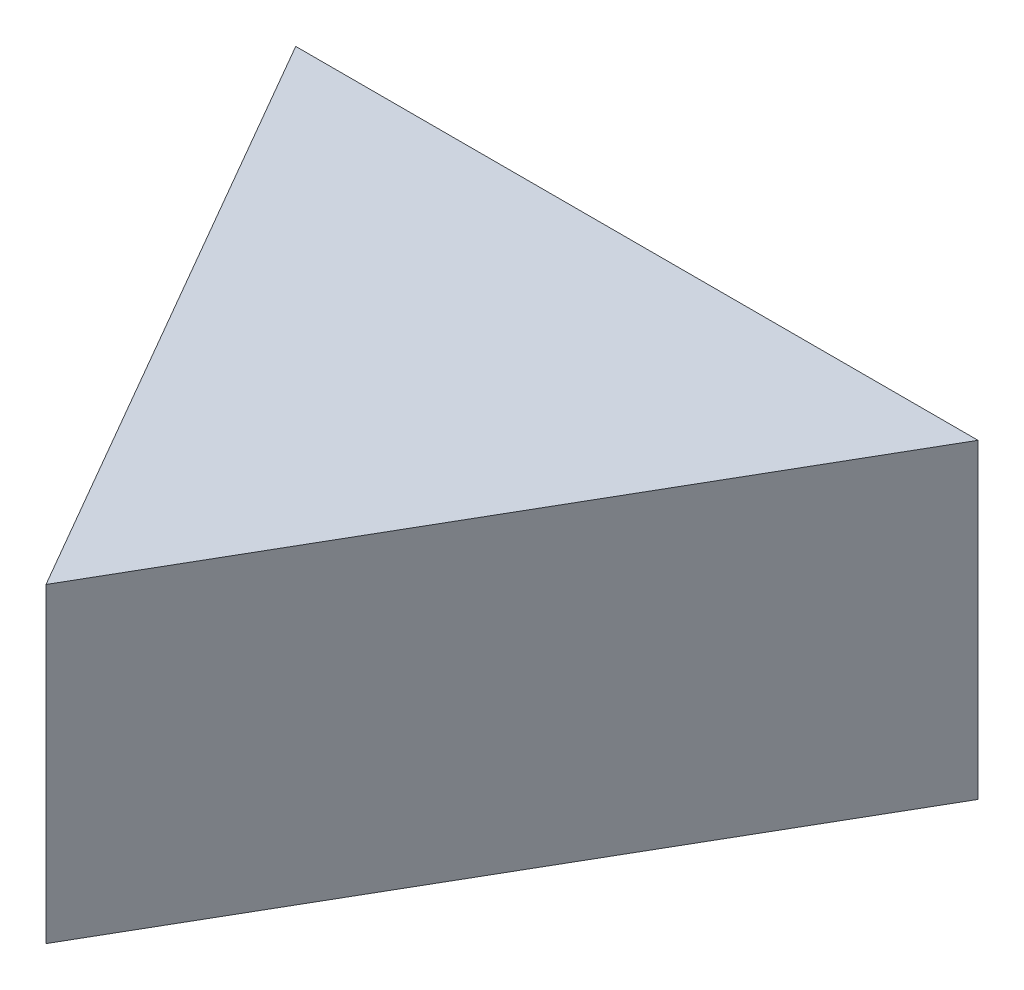
ISO-10303-21;
HEADER;
FILE_DESCRIPTION(('STEP AP214'),'2;1');
FILE_NAME('part.step','',(''),(''),'','','');
FILE_SCHEMA(('AUTOMOTIVE_DESIGN { 1 0 10303 214 1 1 1 1 }'));
ENDSEC;
DATA;
#1=APPLICATION_CONTEXT('core data for automotive mechanical design processes');
#2=APPLICATION_PROTOCOL_DEFINITION('international standard','automotive_design',2000,#1);
#3=PRODUCT_CONTEXT('',#1,'mechanical');
#4=PRODUCT('Part','Part','',(#3));
#5=PRODUCT_RELATED_PRODUCT_CATEGORY('part','',(#4));
#6=PRODUCT_DEFINITION_FORMATION('','',#4);
#7=PRODUCT_DEFINITION_CONTEXT('part definition',#1,'design');
#8=PRODUCT_DEFINITION('design','',#6,#7);
#9=PRODUCT_DEFINITION_SHAPE('','',#8);
#10=(LENGTH_UNIT() NAMED_UNIT(*) SI_UNIT(.MILLI.,.METRE.));
#11=(NAMED_UNIT(*) PLANE_ANGLE_UNIT() SI_UNIT($,.RADIAN.));
#12=(NAMED_UNIT(*) SI_UNIT($,.STERADIAN.) SOLID_ANGLE_UNIT());
#13=UNCERTAINTY_MEASURE_WITH_UNIT(LENGTH_MEASURE(1.E-05),#10,'distance_accuracy_value','');
#14=(GEOMETRIC_REPRESENTATION_CONTEXT(3) GLOBAL_UNCERTAINTY_ASSIGNED_CONTEXT((#13)) GLOBAL_UNIT_ASSIGNED_CONTEXT((#10,
#11,#12)) REPRESENTATION_CONTEXT('',''));
#15=CARTESIAN_POINT('',(0.,0.,0.));
#16=DIRECTION('',(0.,0.,1.));
#17=DIRECTION('',(1.,0.,0.));
#18=AXIS2_PLACEMENT_3D('',#15,#16,#17);
#19=CARTESIAN_POINT('',(44.45,38.1,0.));
#20=DIRECTION('',(0.866025403784438,0.,-0.500000000000001));
#21=DIRECTION('',(-0.500000000000001,0.,-0.866025403784438));
#22=AXIS2_PLACEMENT_3D('',#19,#20,#21);
#23=PLANE('',#22);
#24=DIRECTION('',(0.500000000000001,0.,0.866025403784438));
#25=VECTOR('',#24,1.);
#26=CARTESIAN_POINT('',(44.45,0.,0.));
#27=LINE('',#26,#25);
#28=CARTESIAN_POINT('',(2.66168063417336,0.,-72.3794923045261));
#29=VERTEX_POINT('',#28);
#30=CARTESIAN_POINT('',(44.45,0.,0.));
#31=VERTEX_POINT('',#30);
#32=EDGE_CURVE('E80',#29,#31,#27,.T.);
#33=ORIENTED_EDGE('',*,*,#32,.T.);
#34=DIRECTION('',(0.,-1.,0.));
#35=VECTOR('',#34,1.);
#36=CARTESIAN_POINT('',(44.45,38.1,0.));
#37=LINE('',#36,#35);
#38=CARTESIAN_POINT('',(44.45,38.1,0.));
#39=VERTEX_POINT('',#38);
#40=EDGE_CURVE('E11',#39,#31,#37,.T.);
#41=ORIENTED_EDGE('',*,*,#40,.F.);
#42=DIRECTION('',(0.500000000000001,0.,0.866025403784438));
#43=VECTOR('',#42,1.);
#44=CARTESIAN_POINT('',(44.45,38.1,0.));
#45=LINE('',#44,#43);
#46=CARTESIAN_POINT('',(2.66168063417336,38.1,-72.3794923045261));
#47=VERTEX_POINT('',#46);
#48=EDGE_CURVE('E73',#47,#39,#45,.T.);
#49=ORIENTED_EDGE('',*,*,#48,.F.);
#50=DIRECTION('',(0.,-1.,0.));
#51=VECTOR('',#50,1.);
#52=CARTESIAN_POINT('',(2.66168063417336,38.1,-72.3794923045261));
#53=LINE('',#52,#51);
#54=EDGE_CURVE('E81',#47,#29,#53,.T.);
#55=ORIENTED_EDGE('',*,*,#54,.T.);
#56=EDGE_LOOP('',(#33,#41,#49,#55));
#57=FACE_BOUND('',#56,.T.);
#58=ADVANCED_FACE('F33',(#57),#23,.F.);
#59=CARTESIAN_POINT('',(44.45,38.1,0.));
#60=DIRECTION('',(-0.86602540378444,0.,-0.499999999999997));
#61=DIRECTION('',(-0.499999999999997,0.,0.86602540378444));
#62=AXIS2_PLACEMENT_3D('',#59,#60,#61);
#63=PLANE('',#62);
#64=DIRECTION('',(0.499999999999997,0.,-0.86602540378444));
#65=VECTOR('',#64,1.);
#66=CARTESIAN_POINT('',(44.45,0.,0.));
#67=LINE('',#66,#65);
#68=CARTESIAN_POINT('',(86.2383193658262,0.,-72.3794923045261));
#69=VERTEX_POINT('',#68);
#70=EDGE_CURVE('E61',#31,#69,#67,.T.);
#71=ORIENTED_EDGE('',*,*,#70,.T.);
#72=DIRECTION('',(0.,-1.,0.));
#73=VECTOR('',#72,1.);
#74=CARTESIAN_POINT('',(86.2383193658262,38.1,-72.3794923045261));
#75=LINE('',#74,#73);
#76=CARTESIAN_POINT('',(86.2383193658262,38.1,-72.3794923045261));
#77=VERTEX_POINT('',#76);
#78=EDGE_CURVE('E41',#77,#69,#75,.T.);
#79=ORIENTED_EDGE('',*,*,#78,.F.);
#80=DIRECTION('',(0.499999999999997,0.,-0.86602540378444));
#81=VECTOR('',#80,1.);
#82=CARTESIAN_POINT('',(44.45,38.1,0.));
#83=LINE('',#82,#81);
#84=EDGE_CURVE('E69',#39,#77,#83,.T.);
#85=ORIENTED_EDGE('',*,*,#84,.F.);
#86=ORIENTED_EDGE('',*,*,#40,.T.);
#87=EDGE_LOOP('',(#71,#79,#85,#86));
#88=FACE_BOUND('',#87,.T.);
#89=ADVANCED_FACE('F70',(#88),#63,.F.);
#90=CARTESIAN_POINT('',(2.66168063417336,38.1,-72.3794923045261));
#91=DIRECTION('',(0.,0.,1.));
#92=DIRECTION('',(1.,0.,0.));
#93=AXIS2_PLACEMENT_3D('',#90,#91,#92);
#94=PLANE('',#93);
#95=DIRECTION('',(-1.,0.,0.));
#96=VECTOR('',#95,1.);
#97=CARTESIAN_POINT('',(2.66168063417336,0.,-72.3794923045261));
#98=LINE('',#97,#96);
#99=EDGE_CURVE('E66',#69,#29,#98,.T.);
#100=ORIENTED_EDGE('',*,*,#99,.T.);
#101=ORIENTED_EDGE('',*,*,#54,.F.);
#102=DIRECTION('',(-1.,0.,0.));
#103=VECTOR('',#102,1.);
#104=CARTESIAN_POINT('',(2.66168063417336,38.1,-72.3794923045261));
#105=LINE('',#104,#103);
#106=EDGE_CURVE('E49',#77,#47,#105,.T.);
#107=ORIENTED_EDGE('',*,*,#106,.F.);
#108=ORIENTED_EDGE('',*,*,#78,.T.);
#109=EDGE_LOOP('',(#100,#101,#107,#108));
#110=FACE_BOUND('',#109,.T.);
#111=ADVANCED_FACE('F88',(#110),#94,.F.);
#112=CARTESIAN_POINT('',(0.,38.1,0.));
#113=DIRECTION('',(0.,-1.,0.));
#114=DIRECTION('',(0.,0.,-1.));
#115=AXIS2_PLACEMENT_3D('',#112,#113,#114);
#116=PLANE('',#115);
#117=ORIENTED_EDGE('',*,*,#48,.T.);
#118=ORIENTED_EDGE('',*,*,#84,.T.);
#119=ORIENTED_EDGE('',*,*,#106,.T.);
#120=EDGE_LOOP('',(#117,#118,#119));
#121=FACE_BOUND('',#120,.T.);
#122=ADVANCED_FACE('F76',(#121),#116,.F.);
#123=CARTESIAN_POINT('',(0.,0.,0.));
#124=DIRECTION('',(0.,-1.,0.));
#125=DIRECTION('',(0.,0.,-1.));
#126=AXIS2_PLACEMENT_3D('',#123,#124,#125);
#127=PLANE('',#126);
#128=ORIENTED_EDGE('',*,*,#32,.F.);
#129=ORIENTED_EDGE('',*,*,#99,.F.);
#130=ORIENTED_EDGE('',*,*,#70,.F.);
#131=EDGE_LOOP('',(#128,#129,#130));
#132=FACE_BOUND('',#131,.T.);
#133=ADVANCED_FACE('F89',(#132),#127,.T.);
#134=CLOSED_SHELL('',(#58,#89,#111,#122,#133));
#135=MANIFOLD_SOLID_BREP('B2',#134);
#136=ADVANCED_BREP_SHAPE_REPRESENTATION('',(#18,#135),#14);
#137=SHAPE_DEFINITION_REPRESENTATION(#9,#136);
ENDSEC;
END-ISO-10303-21;
